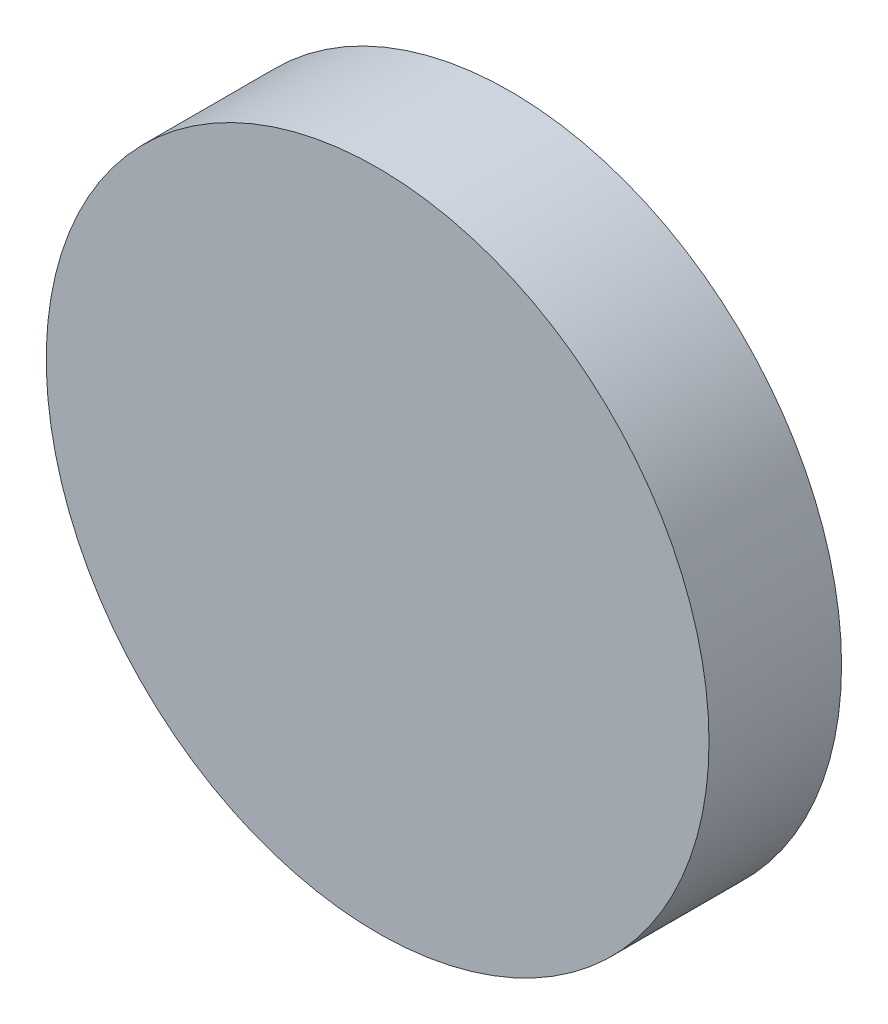
ISO-10303-21;
HEADER;
FILE_DESCRIPTION(('STEP AP214'),'2;1');
FILE_NAME('part.step','',(''),(''),'','','');
FILE_SCHEMA(('AUTOMOTIVE_DESIGN { 1 0 10303 214 1 1 1 1 }'));
ENDSEC;
DATA;
#1=APPLICATION_CONTEXT('core data for automotive mechanical design processes');
#2=APPLICATION_PROTOCOL_DEFINITION('international standard','automotive_design',2000,#1);
#3=PRODUCT_CONTEXT('',#1,'mechanical');
#4=PRODUCT('Part','Part','',(#3));
#5=PRODUCT_RELATED_PRODUCT_CATEGORY('part','',(#4));
#6=PRODUCT_DEFINITION_FORMATION('','',#4);
#7=PRODUCT_DEFINITION_CONTEXT('part definition',#1,'design');
#8=PRODUCT_DEFINITION('design','',#6,#7);
#9=PRODUCT_DEFINITION_SHAPE('','',#8);
#10=(LENGTH_UNIT() NAMED_UNIT(*) SI_UNIT(.MILLI.,.METRE.));
#11=(NAMED_UNIT(*) PLANE_ANGLE_UNIT() SI_UNIT($,.RADIAN.));
#12=(NAMED_UNIT(*) SI_UNIT($,.STERADIAN.) SOLID_ANGLE_UNIT());
#13=UNCERTAINTY_MEASURE_WITH_UNIT(LENGTH_MEASURE(1.E-05),#10,'distance_accuracy_value','');
#14=(GEOMETRIC_REPRESENTATION_CONTEXT(3) GLOBAL_UNCERTAINTY_ASSIGNED_CONTEXT((#13)) GLOBAL_UNIT_ASSIGNED_CONTEXT((#10,
#11,#12)) REPRESENTATION_CONTEXT('',''));
#15=CARTESIAN_POINT('',(0.,0.,0.));
#16=DIRECTION('',(0.,0.,1.));
#17=DIRECTION('',(1.,0.,0.));
#18=AXIS2_PLACEMENT_3D('',#15,#16,#17);
#19=CARTESIAN_POINT('',(0.,0.,6.));
#20=DIRECTION('',(0.,0.,-1.));
#21=DIRECTION('',(-1.,0.,0.));
#22=AXIS2_PLACEMENT_3D('',#19,#20,#21);
#23=CYLINDRICAL_SURFACE('',#22,15.);
#24=CARTESIAN_POINT('',(0.,0.,6.));
#25=DIRECTION('',(0.,0.,1.));
#26=DIRECTION('',(1.,0.,0.));
#27=AXIS2_PLACEMENT_3D('',#24,#25,#26);
#28=CIRCLE('',#27,15.);
#29=CARTESIAN_POINT('',(15.,0.,6.));
#30=VERTEX_POINT('',#29);
#31=EDGE_CURVE('E10',#30,#30,#28,.T.);
#32=ORIENTED_EDGE('',*,*,#31,.F.);
#33=EDGE_LOOP('',(#32));
#34=FACE_BOUND('',#33,.T.);
#35=CARTESIAN_POINT('',(0.,0.,0.));
#36=DIRECTION('',(0.,0.,1.));
#37=DIRECTION('',(1.,0.,0.));
#38=AXIS2_PLACEMENT_3D('',#35,#36,#37);
#39=CIRCLE('',#38,15.);
#40=CARTESIAN_POINT('',(15.,0.,0.));
#41=VERTEX_POINT('',#40);
#42=EDGE_CURVE('E38',#41,#41,#39,.T.);
#43=ORIENTED_EDGE('',*,*,#42,.T.);
#44=EDGE_LOOP('',(#43));
#45=FACE_BOUND('',#44,.T.);
#46=ADVANCED_FACE('F35',(#34,#45),#23,.T.);
#47=CARTESIAN_POINT('',(0.,0.,6.));
#48=DIRECTION('',(0.,0.,1.));
#49=DIRECTION('',(1.,0.,0.));
#50=AXIS2_PLACEMENT_3D('',#47,#48,#49);
#51=PLANE('',#50);
#52=ORIENTED_EDGE('',*,*,#31,.T.);
#53=EDGE_LOOP('',(#52));
#54=FACE_BOUND('',#53,.T.);
#55=ADVANCED_FACE('F50',(#54),#51,.T.);
#56=CARTESIAN_POINT('',(0.,0.,0.));
#57=DIRECTION('',(0.,0.,1.));
#58=DIRECTION('',(1.,0.,0.));
#59=AXIS2_PLACEMENT_3D('',#56,#57,#58);
#60=PLANE('',#59);
#61=ORIENTED_EDGE('',*,*,#42,.F.);
#62=EDGE_LOOP('',(#61));
#63=FACE_BOUND('',#62,.T.);
#64=ADVANCED_FACE('F48',(#63),#60,.F.);
#65=CLOSED_SHELL('',(#46,#55,#64));
#66=MANIFOLD_SOLID_BREP('B2',#65);
#67=ADVANCED_BREP_SHAPE_REPRESENTATION('',(#18,#66),#14);
#68=SHAPE_DEFINITION_REPRESENTATION(#9,#67);
ENDSEC;
END-ISO-10303-21;
